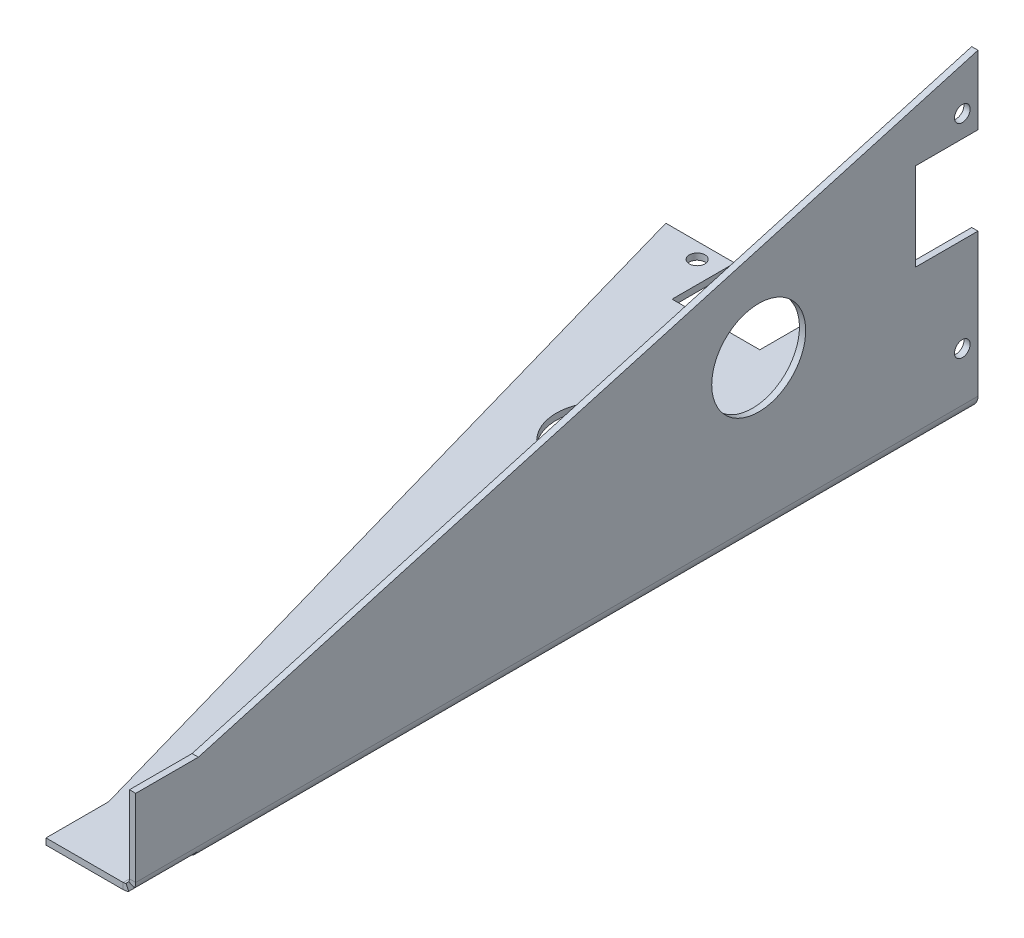
ISO-10303-21;
HEADER;
FILE_DESCRIPTION(('STEP AP214'),'2;1');
FILE_NAME('part.step','',(''),(''),'','','');
FILE_SCHEMA(('AUTOMOTIVE_DESIGN { 1 0 10303 214 1 1 1 1 }'));
ENDSEC;
DATA;
#1=APPLICATION_CONTEXT('core data for automotive mechanical design processes');
#2=APPLICATION_PROTOCOL_DEFINITION('international standard','automotive_design',2000,#1);
#3=PRODUCT_CONTEXT('',#1,'mechanical');
#4=PRODUCT('Part','Part','',(#3));
#5=PRODUCT_RELATED_PRODUCT_CATEGORY('part','',(#4));
#6=PRODUCT_DEFINITION_FORMATION('','',#4);
#7=PRODUCT_DEFINITION_CONTEXT('part definition',#1,'design');
#8=PRODUCT_DEFINITION('design','',#6,#7);
#9=PRODUCT_DEFINITION_SHAPE('','',#8);
#10=(LENGTH_UNIT() NAMED_UNIT(*) SI_UNIT(.MILLI.,.METRE.));
#11=(NAMED_UNIT(*) PLANE_ANGLE_UNIT() SI_UNIT($,.RADIAN.));
#12=(NAMED_UNIT(*) SI_UNIT($,.STERADIAN.) SOLID_ANGLE_UNIT());
#13=UNCERTAINTY_MEASURE_WITH_UNIT(LENGTH_MEASURE(1.E-05),#10,'distance_accuracy_value','');
#14=(GEOMETRIC_REPRESENTATION_CONTEXT(3) GLOBAL_UNCERTAINTY_ASSIGNED_CONTEXT((#13)) GLOBAL_UNIT_ASSIGNED_CONTEXT((#10,
#11,#12)) REPRESENTATION_CONTEXT('',''));
#15=CARTESIAN_POINT('',(0.,0.,0.));
#16=DIRECTION('',(0.,0.,1.));
#17=DIRECTION('',(1.,0.,0.));
#18=AXIS2_PLACEMENT_3D('',#15,#16,#17);
#19=CARTESIAN_POINT('',(-0.356194490192342,-0.356194490192343,0.));
#20=DIRECTION('',(1.,0.,0.));
#21=DIRECTION('',(0.,0.,-1.));
#22=AXIS2_PLACEMENT_3D('',#19,#20,#21);
#23=PLANE('',#22);
#24=CARTESIAN_POINT('',(-0.35619449019251,47.6438055098077,-198.86));
#25=DIRECTION('',(-1.,0.,0.));
#26=DIRECTION('',(0.,0.,1.));
#27=AXIS2_PLACEMENT_3D('',#24,#25,#26);
#28=CIRCLE('',#27,15.);
#29=CARTESIAN_POINT('',(-0.35619449019251,47.6438055098077,-183.86));
#30=VERTEX_POINT('',#29);
#31=EDGE_CURVE('E293',#30,#30,#28,.T.);
#32=ORIENTED_EDGE('',*,*,#31,.F.);
#33=EDGE_LOOP('',(#32));
#34=FACE_BOUND('',#33,.T.);
#35=CARTESIAN_POINT('',(-0.356194490192632,82.6438055098076,-263.86));
#36=DIRECTION('',(-1.,0.,0.));
#37=DIRECTION('',(0.,0.,1.));
#38=AXIS2_PLACEMENT_3D('',#35,#36,#37);
#39=CIRCLE('',#38,2.50000000000001);
#40=CARTESIAN_POINT('',(-0.356194490192632,82.6438055098076,-261.36));
#41=VERTEX_POINT('',#40);
#42=EDGE_CURVE('E285',#41,#41,#39,.T.);
#43=ORIENTED_EDGE('',*,*,#42,.F.);
#44=EDGE_LOOP('',(#43));
#45=FACE_BOUND('',#44,.T.);
#46=CARTESIAN_POINT('',(-0.356194490192405,17.6438055098077,-263.86));
#47=DIRECTION('',(-1.,0.,0.));
#48=DIRECTION('',(0.,0.,1.));
#49=AXIS2_PLACEMENT_3D('',#46,#47,#48);
#50=CIRCLE('',#49,2.5);
#51=CARTESIAN_POINT('',(-0.356194490192405,17.6438055098077,-261.36));
#52=VERTEX_POINT('',#51);
#53=EDGE_CURVE('E286',#52,#52,#50,.T.);
#54=ORIENTED_EDGE('',*,*,#53,.F.);
#55=EDGE_LOOP('',(#54));
#56=FACE_BOUND('',#55,.T.);
#57=DIRECTION('',(0.,-1.,0.));
#58=VECTOR('',#57,1.);
#59=CARTESIAN_POINT('',(-0.35619449019251,47.6438055098077,-268.86));
#60=LINE('',#59,#58);
#61=CARTESIAN_POINT('',(-0.35619449019251,47.6438055098077,-268.86));
#62=VERTEX_POINT('',#61);
#63=CARTESIAN_POINT('',(-0.35619449019235,2.00000000000001,-268.86));
#64=VERTEX_POINT('',#63);
#65=EDGE_CURVE('E58',#62,#64,#60,.T.);
#66=ORIENTED_EDGE('',*,*,#65,.T.);
#67=DIRECTION('',(0.,0.,1.));
#68=VECTOR('',#67,1.);
#69=CARTESIAN_POINT('',(-0.35619449019235,2.00000000000001,0.));
#70=LINE('',#69,#68);
#71=CARTESIAN_POINT('',(-0.35619449019235,2.00000000000001,0.));
#72=VERTEX_POINT('',#71);
#73=EDGE_CURVE('E50',#64,#72,#70,.T.);
#74=ORIENTED_EDGE('',*,*,#73,.T.);
#75=DIRECTION('',(0.,1.,0.));
#76=VECTOR('',#75,1.);
#77=CARTESIAN_POINT('',(-0.356194490192346,0.64380550980766,0.));
#78=LINE('',#77,#76);
#79=CARTESIAN_POINT('',(-0.356194490192436,26.6438055098077,0.));
#80=VERTEX_POINT('',#79);
#81=EDGE_CURVE('E66',#72,#80,#78,.T.);
#82=ORIENTED_EDGE('',*,*,#81,.T.);
#83=DIRECTION('',(0.,0.,-1.));
#84=VECTOR('',#83,1.);
#85=CARTESIAN_POINT('',(-0.356194490192436,26.6438055098077,0.));
#86=LINE('',#85,#84);
#87=CARTESIAN_POINT('',(-0.356194490192436,26.6438055098077,-20.));
#88=VERTEX_POINT('',#87);
#89=EDGE_CURVE('E320',#80,#88,#86,.T.);
#90=ORIENTED_EDGE('',*,*,#89,.T.);
#91=DIRECTION('',(0.,0.274353650382612,-0.961628865270659));
#92=VECTOR('',#91,1.);
#93=CARTESIAN_POINT('',(-0.356194490192436,26.6438055098077,-20.));
#94=LINE('',#93,#92);
#95=CARTESIAN_POINT('',(-0.356194490192684,97.6438055098076,-268.86));
#96=VERTEX_POINT('',#95);
#97=EDGE_CURVE('E323',#88,#96,#94,.T.);
#98=ORIENTED_EDGE('',*,*,#97,.T.);
#99=DIRECTION('',(0.,-1.,0.));
#100=VECTOR('',#99,1.);
#101=CARTESIAN_POINT('',(-0.356194490192684,97.6438055098076,-268.86));
#102=LINE('',#101,#100);
#103=CARTESIAN_POINT('',(-0.356194490192608,75.6438055098077,-268.86));
#104=VERTEX_POINT('',#103);
#105=EDGE_CURVE('E326',#96,#104,#102,.T.);
#106=ORIENTED_EDGE('',*,*,#105,.T.);
#107=DIRECTION('',(0.,0.,1.));
#108=VECTOR('',#107,1.);
#109=CARTESIAN_POINT('',(-0.356194490192608,75.6438055098077,-268.86));
#110=LINE('',#109,#108);
#111=CARTESIAN_POINT('',(-0.356194490192608,75.6438055098076,-248.86));
#112=VERTEX_POINT('',#111);
#113=EDGE_CURVE('E329',#104,#112,#110,.T.);
#114=ORIENTED_EDGE('',*,*,#113,.T.);
#115=DIRECTION('',(0.,-1.,0.));
#116=VECTOR('',#115,1.);
#117=CARTESIAN_POINT('',(-0.356194490192608,75.6438055098076,-248.86));
#118=LINE('',#117,#116);
#119=CARTESIAN_POINT('',(-0.35619449019251,47.6438055098077,-248.86));
#120=VERTEX_POINT('',#119);
#121=EDGE_CURVE('E332',#112,#120,#118,.T.);
#122=ORIENTED_EDGE('',*,*,#121,.T.);
#123=DIRECTION('',(0.,0.,-1.));
#124=VECTOR('',#123,1.);
#125=CARTESIAN_POINT('',(-0.35619449019251,47.6438055098077,-248.86));
#126=LINE('',#125,#124);
#127=EDGE_CURVE('E335',#120,#62,#126,.T.);
#128=ORIENTED_EDGE('',*,*,#127,.T.);
#129=EDGE_LOOP('',(#66,#74,#82,#90,#98,#106,#114,#122,#128));
#130=FACE_BOUND('',#129,.T.);
#131=ADVANCED_FACE('F41',(#34,#45,#56,#130),#23,.F.);
#132=CARTESIAN_POINT('',(1.64380550980749,47.6438055098077,-268.86));
#133=DIRECTION('',(0.,0.,-1.));
#134=DIRECTION('',(0.,-1.,0.));
#135=AXIS2_PLACEMENT_3D('',#132,#133,#134);
#136=PLANE('',#135);
#137=DIRECTION('',(1.,0.,0.));
#138=VECTOR('',#137,1.);
#139=CARTESIAN_POINT('',(1.64380550980765,2.00000000000002,-268.86));
#140=LINE('',#139,#138);
#141=CARTESIAN_POINT('',(1.64380550980765,2.00000000000002,-268.86));
#142=VERTEX_POINT('',#141);
#143=EDGE_CURVE('E12',#64,#142,#140,.T.);
#144=ORIENTED_EDGE('',*,*,#143,.F.);
#145=ORIENTED_EDGE('',*,*,#65,.F.);
#146=DIRECTION('',(-1.,0.,0.));
#147=VECTOR('',#146,1.);
#148=CARTESIAN_POINT('',(1.64380550980749,47.6438055098077,-268.86));
#149=LINE('',#148,#147);
#150=CARTESIAN_POINT('',(1.64380550980749,47.6438055098077,-268.86));
#151=VERTEX_POINT('',#150);
#152=EDGE_CURVE('E337',#151,#62,#149,.T.);
#153=ORIENTED_EDGE('',*,*,#152,.F.);
#154=DIRECTION('',(0.,-1.,0.));
#155=VECTOR('',#154,1.);
#156=CARTESIAN_POINT('',(1.64380550980749,47.6438055098077,-268.86));
#157=LINE('',#156,#155);
#158=EDGE_CURVE('E319',#151,#142,#157,.T.);
#159=ORIENTED_EDGE('',*,*,#158,.T.);
#160=EDGE_LOOP('',(#144,#145,#153,#159));
#161=FACE_BOUND('',#160,.T.);
#162=ADVANCED_FACE('F43',(#161),#136,.T.);
#163=CARTESIAN_POINT('',(1.64380550980749,47.6438055098077,-248.86));
#164=DIRECTION('',(0.,1.,0.));
#165=DIRECTION('',(0.,0.,-1.));
#166=AXIS2_PLACEMENT_3D('',#163,#164,#165);
#167=PLANE('',#166);
#168=ORIENTED_EDGE('',*,*,#127,.F.);
#169=DIRECTION('',(-1.,0.,0.));
#170=VECTOR('',#169,1.);
#171=CARTESIAN_POINT('',(1.64380550980749,47.6438055098077,-248.86));
#172=LINE('',#171,#170);
#173=CARTESIAN_POINT('',(1.64380550980749,47.6438055098077,-248.86));
#174=VERTEX_POINT('',#173);
#175=EDGE_CURVE('E340',#174,#120,#172,.T.);
#176=ORIENTED_EDGE('',*,*,#175,.F.);
#177=DIRECTION('',(0.,0.,-1.));
#178=VECTOR('',#177,1.);
#179=CARTESIAN_POINT('',(1.64380550980749,47.6438055098077,-248.86));
#180=LINE('',#179,#178);
#181=EDGE_CURVE('E316',#174,#151,#180,.T.);
#182=ORIENTED_EDGE('',*,*,#181,.T.);
#183=ORIENTED_EDGE('',*,*,#152,.T.);
#184=EDGE_LOOP('',(#168,#176,#182,#183));
#185=FACE_BOUND('',#184,.T.);
#186=ADVANCED_FACE('F482',(#185),#167,.T.);
#187=CARTESIAN_POINT('',(1.64380550980739,75.6438055098077,-248.86));
#188=DIRECTION('',(0.,0.,-1.));
#189=DIRECTION('',(0.,-1.,0.));
#190=AXIS2_PLACEMENT_3D('',#187,#188,#189);
#191=PLANE('',#190);
#192=ORIENTED_EDGE('',*,*,#121,.F.);
#193=DIRECTION('',(-1.,0.,0.));
#194=VECTOR('',#193,1.);
#195=CARTESIAN_POINT('',(1.64380550980739,75.6438055098077,-248.86));
#196=LINE('',#195,#194);
#197=CARTESIAN_POINT('',(1.64380550980739,75.6438055098077,-248.86));
#198=VERTEX_POINT('',#197);
#199=EDGE_CURVE('E342',#198,#112,#196,.T.);
#200=ORIENTED_EDGE('',*,*,#199,.F.);
#201=DIRECTION('',(0.,-1.,0.));
#202=VECTOR('',#201,1.);
#203=CARTESIAN_POINT('',(1.64380550980739,75.6438055098077,-248.86));
#204=LINE('',#203,#202);
#205=EDGE_CURVE('E313',#198,#174,#204,.T.);
#206=ORIENTED_EDGE('',*,*,#205,.T.);
#207=ORIENTED_EDGE('',*,*,#175,.T.);
#208=EDGE_LOOP('',(#192,#200,#206,#207));
#209=FACE_BOUND('',#208,.T.);
#210=ADVANCED_FACE('F503',(#209),#191,.T.);
#211=CARTESIAN_POINT('',(1.64380550980739,75.6438055098077,-268.86));
#212=DIRECTION('',(0.,-1.,0.));
#213=DIRECTION('',(0.,0.,1.));
#214=AXIS2_PLACEMENT_3D('',#211,#212,#213);
#215=PLANE('',#214);
#216=ORIENTED_EDGE('',*,*,#113,.F.);
#217=DIRECTION('',(-1.,0.,0.));
#218=VECTOR('',#217,1.);
#219=CARTESIAN_POINT('',(1.64380550980739,75.6438055098077,-268.86));
#220=LINE('',#219,#218);
#221=CARTESIAN_POINT('',(1.64380550980739,75.6438055098077,-268.86));
#222=VERTEX_POINT('',#221);
#223=EDGE_CURVE('E344',#222,#104,#220,.T.);
#224=ORIENTED_EDGE('',*,*,#223,.F.);
#225=DIRECTION('',(0.,0.,1.));
#226=VECTOR('',#225,1.);
#227=CARTESIAN_POINT('',(1.64380550980739,75.6438055098077,-268.86));
#228=LINE('',#227,#226);
#229=EDGE_CURVE('E310',#222,#198,#228,.T.);
#230=ORIENTED_EDGE('',*,*,#229,.T.);
#231=ORIENTED_EDGE('',*,*,#199,.T.);
#232=EDGE_LOOP('',(#216,#224,#230,#231));
#233=FACE_BOUND('',#232,.T.);
#234=ADVANCED_FACE('F499',(#233),#215,.T.);
#235=CARTESIAN_POINT('',(1.64380550980732,97.6438055098077,-268.86));
#236=DIRECTION('',(0.,0.,-1.));
#237=DIRECTION('',(0.,-1.,0.));
#238=AXIS2_PLACEMENT_3D('',#235,#236,#237);
#239=PLANE('',#238);
#240=ORIENTED_EDGE('',*,*,#105,.F.);
#241=DIRECTION('',(-1.,0.,0.));
#242=VECTOR('',#241,1.);
#243=CARTESIAN_POINT('',(1.64380550980732,97.6438055098077,-268.86));
#244=LINE('',#243,#242);
#245=CARTESIAN_POINT('',(1.64380550980732,97.6438055098077,-268.86));
#246=VERTEX_POINT('',#245);
#247=EDGE_CURVE('E346',#246,#96,#244,.T.);
#248=ORIENTED_EDGE('',*,*,#247,.F.);
#249=DIRECTION('',(0.,-1.,0.));
#250=VECTOR('',#249,1.);
#251=CARTESIAN_POINT('',(1.64380550980732,97.6438055098077,-268.86));
#252=LINE('',#251,#250);
#253=EDGE_CURVE('E307',#246,#222,#252,.T.);
#254=ORIENTED_EDGE('',*,*,#253,.T.);
#255=ORIENTED_EDGE('',*,*,#223,.T.);
#256=EDGE_LOOP('',(#240,#248,#254,#255));
#257=FACE_BOUND('',#256,.T.);
#258=ADVANCED_FACE('F496',(#257),#239,.T.);
#259=CARTESIAN_POINT('',(1.64380550980756,26.6438055098077,-20.));
#260=DIRECTION('',(0.,0.961628865270659,0.274353650382612));
#261=DIRECTION('',(0.,0.274353650382612,-0.961628865270659));
#262=AXIS2_PLACEMENT_3D('',#259,#260,#261);
#263=PLANE('',#262);
#264=ORIENTED_EDGE('',*,*,#97,.F.);
#265=DIRECTION('',(-1.,0.,0.));
#266=VECTOR('',#265,1.);
#267=CARTESIAN_POINT('',(1.64380550980756,26.6438055098077,-20.));
#268=LINE('',#267,#266);
#269=CARTESIAN_POINT('',(1.64380550980756,26.6438055098077,-20.));
#270=VERTEX_POINT('',#269);
#271=EDGE_CURVE('E348',#270,#88,#268,.T.);
#272=ORIENTED_EDGE('',*,*,#271,.F.);
#273=DIRECTION('',(0.,0.274353650382612,-0.961628865270659));
#274=VECTOR('',#273,1.);
#275=CARTESIAN_POINT('',(1.64380550980756,26.6438055098077,-20.));
#276=LINE('',#275,#274);
#277=EDGE_CURVE('E304',#270,#246,#276,.T.);
#278=ORIENTED_EDGE('',*,*,#277,.T.);
#279=ORIENTED_EDGE('',*,*,#247,.T.);
#280=EDGE_LOOP('',(#264,#272,#278,#279));
#281=FACE_BOUND('',#280,.T.);
#282=ADVANCED_FACE('F375',(#281),#263,.T.);
#283=CARTESIAN_POINT('',(1.64380550980756,26.6438055098077,0.));
#284=DIRECTION('',(0.,1.,0.));
#285=DIRECTION('',(0.,0.,-1.));
#286=AXIS2_PLACEMENT_3D('',#283,#284,#285);
#287=PLANE('',#286);
#288=ORIENTED_EDGE('',*,*,#89,.F.);
#289=DIRECTION('',(-1.,0.,0.));
#290=VECTOR('',#289,1.);
#291=CARTESIAN_POINT('',(1.64380550980756,26.6438055098077,0.));
#292=LINE('',#291,#290);
#293=CARTESIAN_POINT('',(1.64380550980756,26.6438055098077,0.));
#294=VERTEX_POINT('',#293);
#295=EDGE_CURVE('E350',#294,#80,#292,.T.);
#296=ORIENTED_EDGE('',*,*,#295,.F.);
#297=DIRECTION('',(0.,0.,-1.));
#298=VECTOR('',#297,1.);
#299=CARTESIAN_POINT('',(1.64380550980756,26.6438055098077,0.));
#300=LINE('',#299,#298);
#301=EDGE_CURVE('E301',#294,#270,#300,.T.);
#302=ORIENTED_EDGE('',*,*,#301,.T.);
#303=ORIENTED_EDGE('',*,*,#271,.T.);
#304=EDGE_LOOP('',(#288,#296,#302,#303));
#305=FACE_BOUND('',#304,.T.);
#306=ADVANCED_FACE('F367',(#305),#287,.T.);
#307=CARTESIAN_POINT('',(1.64380550980765,0.643805509807667,0.));
#308=DIRECTION('',(0.,0.,1.));
#309=DIRECTION('',(0.,1.,0.));
#310=AXIS2_PLACEMENT_3D('',#307,#308,#309);
#311=PLANE('',#310);
#312=DIRECTION('',(-1.,0.,0.));
#313=VECTOR('',#312,1.);
#314=CARTESIAN_POINT('',(1.64380550980765,2.00000000000001,0.));
#315=LINE('',#314,#313);
#316=CARTESIAN_POINT('',(1.64380550980765,2.00000000000001,-1.11022302462516E-13));
#317=VERTEX_POINT('',#316);
#318=EDGE_CURVE('E354',#317,#72,#315,.T.);
#319=ORIENTED_EDGE('',*,*,#318,.F.);
#320=DIRECTION('',(0.,1.,0.));
#321=VECTOR('',#320,1.);
#322=CARTESIAN_POINT('',(1.64380550980765,0.643805509807667,0.));
#323=LINE('',#322,#321);
#324=EDGE_CURVE('E45',#317,#294,#323,.T.);
#325=ORIENTED_EDGE('',*,*,#324,.T.);
#326=ORIENTED_EDGE('',*,*,#295,.T.);
#327=ORIENTED_EDGE('',*,*,#81,.F.);
#328=EDGE_LOOP('',(#319,#325,#326,#327));
#329=FACE_BOUND('',#328,.T.);
#330=ADVANCED_FACE('F362',(#329),#311,.T.);
#331=CARTESIAN_POINT('',(1.64380550980766,-0.356194490192336,0.));
#332=DIRECTION('',(1.,0.,0.));
#333=DIRECTION('',(0.,0.,-1.));
#334=AXIS2_PLACEMENT_3D('',#331,#332,#333);
#335=PLANE('',#334);
#336=DIRECTION('',(0.,0.,1.));
#337=VECTOR('',#336,1.);
#338=CARTESIAN_POINT('',(1.64380550980765,2.00000000000001,0.));
#339=LINE('',#338,#337);
#340=EDGE_CURVE('E339',#142,#317,#339,.T.);
#341=ORIENTED_EDGE('',*,*,#340,.F.);
#342=ORIENTED_EDGE('',*,*,#158,.F.);
#343=ORIENTED_EDGE('',*,*,#181,.F.);
#344=ORIENTED_EDGE('',*,*,#205,.F.);
#345=ORIENTED_EDGE('',*,*,#229,.F.);
#346=ORIENTED_EDGE('',*,*,#253,.F.);
#347=ORIENTED_EDGE('',*,*,#277,.F.);
#348=ORIENTED_EDGE('',*,*,#301,.F.);
#349=ORIENTED_EDGE('',*,*,#324,.F.);
#350=EDGE_LOOP('',(#341,#342,#343,#344,#345,#346,#347,#348,#349));
#351=FACE_BOUND('',#350,.T.);
#352=CARTESIAN_POINT('',(1.64380550980759,17.6438055098077,-263.86));
#353=DIRECTION('',(-1.,0.,0.));
#354=DIRECTION('',(0.,0.,1.));
#355=AXIS2_PLACEMENT_3D('',#352,#353,#354);
#356=CIRCLE('',#355,2.5);
#357=CARTESIAN_POINT('',(1.64380550980759,17.6438055098077,-261.36));
#358=VERTEX_POINT('',#357);
#359=EDGE_CURVE('E282',#358,#358,#356,.T.);
#360=ORIENTED_EDGE('',*,*,#359,.T.);
#361=EDGE_LOOP('',(#360));
#362=FACE_BOUND('',#361,.T.);
#363=CARTESIAN_POINT('',(1.64380550980737,82.6438055098077,-263.86));
#364=DIRECTION('',(-1.,0.,0.));
#365=DIRECTION('',(0.,0.,1.));
#366=AXIS2_PLACEMENT_3D('',#363,#364,#365);
#367=CIRCLE('',#366,2.50000000000001);
#368=CARTESIAN_POINT('',(1.64380550980737,82.6438055098077,-261.36));
#369=VERTEX_POINT('',#368);
#370=EDGE_CURVE('E290',#369,#369,#367,.T.);
#371=ORIENTED_EDGE('',*,*,#370,.T.);
#372=EDGE_LOOP('',(#371));
#373=FACE_BOUND('',#372,.T.);
#374=CARTESIAN_POINT('',(1.64380550980749,47.6438055098077,-198.86));
#375=DIRECTION('',(-1.,0.,0.));
#376=DIRECTION('',(0.,0.,1.));
#377=AXIS2_PLACEMENT_3D('',#374,#375,#376);
#378=CIRCLE('',#377,15.);
#379=CARTESIAN_POINT('',(1.64380550980749,47.6438055098077,-183.86));
#380=VERTEX_POINT('',#379);
#381=EDGE_CURVE('E296',#380,#380,#378,.T.);
#382=ORIENTED_EDGE('',*,*,#381,.T.);
#383=EDGE_LOOP('',(#382));
#384=FACE_BOUND('',#383,.T.);
#385=ADVANCED_FACE('F369',(#351,#362,#373,#384),#335,.T.);
#386=CARTESIAN_POINT('',(1.64380550980749,47.6438055098077,-198.86));
#387=DIRECTION('',(-1.,0.,0.));
#388=DIRECTION('',(0.,0.,1.));
#389=AXIS2_PLACEMENT_3D('',#386,#387,#388);
#390=CYLINDRICAL_SURFACE('',#389,15.);
#391=ORIENTED_EDGE('',*,*,#381,.F.);
#392=EDGE_LOOP('',(#391));
#393=FACE_BOUND('',#392,.T.);
#394=ORIENTED_EDGE('',*,*,#31,.T.);
#395=EDGE_LOOP('',(#394));
#396=FACE_BOUND('',#395,.T.);
#397=ADVANCED_FACE('F491',(#393,#396),#390,.F.);
#398=CARTESIAN_POINT('',(1.64380550980737,82.6438055098077,-263.86));
#399=DIRECTION('',(-1.,0.,0.));
#400=DIRECTION('',(0.,0.,1.));
#401=AXIS2_PLACEMENT_3D('',#398,#399,#400);
#402=CYLINDRICAL_SURFACE('',#401,2.50000000000001);
#403=ORIENTED_EDGE('',*,*,#370,.F.);
#404=EDGE_LOOP('',(#403));
#405=FACE_BOUND('',#404,.T.);
#406=ORIENTED_EDGE('',*,*,#42,.T.);
#407=EDGE_LOOP('',(#406));
#408=FACE_BOUND('',#407,.T.);
#409=ADVANCED_FACE('F513',(#405,#408),#402,.F.);
#410=CARTESIAN_POINT('',(1.64380550980759,17.6438055098077,-263.86));
#411=DIRECTION('',(-1.,0.,0.));
#412=DIRECTION('',(0.,0.,1.));
#413=AXIS2_PLACEMENT_3D('',#410,#411,#412);
#414=CYLINDRICAL_SURFACE('',#413,2.5);
#415=ORIENTED_EDGE('',*,*,#359,.F.);
#416=EDGE_LOOP('',(#415));
#417=FACE_BOUND('',#416,.T.);
#418=ORIENTED_EDGE('',*,*,#53,.T.);
#419=EDGE_LOOP('',(#418));
#420=FACE_BOUND('',#419,.T.);
#421=ADVANCED_FACE('F517',(#417,#420),#414,.F.);
#422=CARTESIAN_POINT('',(-48.,-2.,-248.86));
#423=DIRECTION('',(-1.,0.,0.));
#424=DIRECTION('',(0.,0.,1.));
#425=AXIS2_PLACEMENT_3D('',#422,#423,#424);
#426=PLANE('',#425);
#427=DIRECTION('',(0.,0.,1.));
#428=VECTOR('',#427,1.);
#429=CARTESIAN_POINT('',(-48.,0.,-248.86));
#430=LINE('',#429,#428);
#431=CARTESIAN_POINT('',(-48.,0.,-268.86));
#432=VERTEX_POINT('',#431);
#433=CARTESIAN_POINT('',(-48.,0.,-248.86));
#434=VERTEX_POINT('',#433);
#435=EDGE_CURVE('E434',#432,#434,#430,.T.);
#436=ORIENTED_EDGE('',*,*,#435,.F.);
#437=DIRECTION('',(0.,1.,0.));
#438=VECTOR('',#437,1.);
#439=CARTESIAN_POINT('',(-48.,-2.,-268.86));
#440=LINE('',#439,#438);
#441=CARTESIAN_POINT('',(-48.,-2.,-268.86));
#442=VERTEX_POINT('',#441);
#443=EDGE_CURVE('E289',#442,#432,#440,.T.);
#444=ORIENTED_EDGE('',*,*,#443,.F.);
#445=DIRECTION('',(0.,0.,1.));
#446=VECTOR('',#445,1.);
#447=CARTESIAN_POINT('',(-48.,-2.,-248.86));
#448=LINE('',#447,#446);
#449=CARTESIAN_POINT('',(-48.,-2.,-248.86));
#450=VERTEX_POINT('',#449);
#451=EDGE_CURVE('E276',#442,#450,#448,.T.);
#452=ORIENTED_EDGE('',*,*,#451,.T.);
#453=DIRECTION('',(0.,1.,0.));
#454=VECTOR('',#453,1.);
#455=CARTESIAN_POINT('',(-48.,-2.,-248.86));
#456=LINE('',#455,#454);
#457=EDGE_CURVE('E274',#450,#434,#456,.T.);
#458=ORIENTED_EDGE('',*,*,#457,.T.);
#459=EDGE_LOOP('',(#436,#444,#452,#458));
#460=FACE_BOUND('',#459,.T.);
#461=ADVANCED_FACE('F446',(#460),#426,.T.);
#462=CARTESIAN_POINT('',(-76.,-2.,-248.86));
#463=DIRECTION('',(0.,0.,-1.));
#464=DIRECTION('',(-1.,0.,0.));
#465=AXIS2_PLACEMENT_3D('',#462,#463,#464);
#466=PLANE('',#465);
#467=DIRECTION('',(-1.,0.,0.));
#468=VECTOR('',#467,1.);
#469=CARTESIAN_POINT('',(-76.,0.,-248.86));
#470=LINE('',#469,#468);
#471=CARTESIAN_POINT('',(-76.,0.,-248.86));
#472=VERTEX_POINT('',#471);
#473=EDGE_CURVE('E431',#434,#472,#470,.T.);
#474=ORIENTED_EDGE('',*,*,#473,.F.);
#475=ORIENTED_EDGE('',*,*,#457,.F.);
#476=DIRECTION('',(-1.,0.,0.));
#477=VECTOR('',#476,1.);
#478=CARTESIAN_POINT('',(-76.,-2.,-248.86));
#479=LINE('',#478,#477);
#480=CARTESIAN_POINT('',(-76.,-2.,-248.86));
#481=VERTEX_POINT('',#480);
#482=EDGE_CURVE('E271',#450,#481,#479,.T.);
#483=ORIENTED_EDGE('',*,*,#482,.T.);
#484=DIRECTION('',(0.,1.,0.));
#485=VECTOR('',#484,1.);
#486=CARTESIAN_POINT('',(-76.,-2.,-248.86));
#487=LINE('',#486,#485);
#488=EDGE_CURVE('E269',#481,#472,#487,.T.);
#489=ORIENTED_EDGE('',*,*,#488,.T.);
#490=EDGE_LOOP('',(#474,#475,#483,#489));
#491=FACE_BOUND('',#490,.T.);
#492=ADVANCED_FACE('F450',(#491),#466,.T.);
#493=CARTESIAN_POINT('',(-76.,-2.,-268.86));
#494=DIRECTION('',(1.,0.,0.));
#495=DIRECTION('',(0.,0.,-1.));
#496=AXIS2_PLACEMENT_3D('',#493,#494,#495);
#497=PLANE('',#496);
#498=DIRECTION('',(0.,0.,-1.));
#499=VECTOR('',#498,1.);
#500=CARTESIAN_POINT('',(-76.,0.,-268.86));
#501=LINE('',#500,#499);
#502=CARTESIAN_POINT('',(-76.,0.,-268.86));
#503=VERTEX_POINT('',#502);
#504=EDGE_CURVE('E428',#472,#503,#501,.T.);
#505=ORIENTED_EDGE('',*,*,#504,.F.);
#506=ORIENTED_EDGE('',*,*,#488,.F.);
#507=DIRECTION('',(0.,0.,-1.));
#508=VECTOR('',#507,1.);
#509=CARTESIAN_POINT('',(-76.,-2.,-268.86));
#510=LINE('',#509,#508);
#511=CARTESIAN_POINT('',(-76.,-2.,-268.86));
#512=VERTEX_POINT('',#511);
#513=EDGE_CURVE('E266',#481,#512,#510,.T.);
#514=ORIENTED_EDGE('',*,*,#513,.T.);
#515=DIRECTION('',(0.,1.,0.));
#516=VECTOR('',#515,1.);
#517=CARTESIAN_POINT('',(-76.,-2.,-268.86));
#518=LINE('',#517,#516);
#519=EDGE_CURVE('E264',#512,#503,#518,.T.);
#520=ORIENTED_EDGE('',*,*,#519,.T.);
#521=EDGE_LOOP('',(#505,#506,#514,#520));
#522=FACE_BOUND('',#521,.T.);
#523=ADVANCED_FACE('F454',(#522),#497,.T.);
#524=CARTESIAN_POINT('',(-98.,-2.,-268.86));
#525=DIRECTION('',(0.,0.,-1.));
#526=DIRECTION('',(-1.,0.,0.));
#527=AXIS2_PLACEMENT_3D('',#524,#525,#526);
#528=PLANE('',#527);
#529=DIRECTION('',(-1.,0.,0.));
#530=VECTOR('',#529,1.);
#531=CARTESIAN_POINT('',(-98.,0.,-268.86));
#532=LINE('',#531,#530);
#533=CARTESIAN_POINT('',(-98.,0.,-268.86));
#534=VERTEX_POINT('',#533);
#535=EDGE_CURVE('E425',#503,#534,#532,.T.);
#536=ORIENTED_EDGE('',*,*,#535,.F.);
#537=ORIENTED_EDGE('',*,*,#519,.F.);
#538=DIRECTION('',(-1.,0.,0.));
#539=VECTOR('',#538,1.);
#540=CARTESIAN_POINT('',(-98.,-2.,-268.86));
#541=LINE('',#540,#539);
#542=CARTESIAN_POINT('',(-98.,-2.,-268.86));
#543=VERTEX_POINT('',#542);
#544=EDGE_CURVE('E261',#512,#543,#541,.T.);
#545=ORIENTED_EDGE('',*,*,#544,.T.);
#546=DIRECTION('',(0.,1.,0.));
#547=VECTOR('',#546,1.);
#548=CARTESIAN_POINT('',(-98.,-2.,-268.86));
#549=LINE('',#548,#547);
#550=EDGE_CURVE('E259',#543,#534,#549,.T.);
#551=ORIENTED_EDGE('',*,*,#550,.T.);
#552=EDGE_LOOP('',(#536,#537,#545,#551));
#553=FACE_BOUND('',#552,.T.);
#554=ADVANCED_FACE('F458',(#553),#528,.T.);
#555=CARTESIAN_POINT('',(-27.,-2.,-20.));
#556=DIRECTION('',(-0.961628865270659,0.,0.274353650382612));
#557=DIRECTION('',(0.274353650382612,0.,0.961628865270659));
#558=AXIS2_PLACEMENT_3D('',#555,#556,#557);
#559=PLANE('',#558);
#560=DIRECTION('',(0.274353650382612,0.,0.961628865270659));
#561=VECTOR('',#560,1.);
#562=CARTESIAN_POINT('',(-27.,0.,-20.));
#563=LINE('',#562,#561);
#564=CARTESIAN_POINT('',(-27.,0.,-20.));
#565=VERTEX_POINT('',#564);
#566=EDGE_CURVE('E422',#534,#565,#563,.T.);
#567=ORIENTED_EDGE('',*,*,#566,.F.);
#568=ORIENTED_EDGE('',*,*,#550,.F.);
#569=DIRECTION('',(0.274353650382612,0.,0.961628865270659));
#570=VECTOR('',#569,1.);
#571=CARTESIAN_POINT('',(-27.,-2.,-20.));
#572=LINE('',#571,#570);
#573=CARTESIAN_POINT('',(-27.,-2.,-20.));
#574=VERTEX_POINT('',#573);
#575=EDGE_CURVE('E256',#543,#574,#572,.T.);
#576=ORIENTED_EDGE('',*,*,#575,.T.);
#577=DIRECTION('',(0.,1.,0.));
#578=VECTOR('',#577,1.);
#579=CARTESIAN_POINT('',(-27.,-2.,-20.));
#580=LINE('',#579,#578);
#581=EDGE_CURVE('E254',#574,#565,#580,.T.);
#582=ORIENTED_EDGE('',*,*,#581,.T.);
#583=EDGE_LOOP('',(#567,#568,#576,#582));
#584=FACE_BOUND('',#583,.T.);
#585=ADVANCED_FACE('F462',(#584),#559,.T.);
#586=CARTESIAN_POINT('',(-27.,-2.,0.));
#587=DIRECTION('',(-1.,0.,0.));
#588=DIRECTION('',(0.,0.,1.));
#589=AXIS2_PLACEMENT_3D('',#586,#587,#588);
#590=PLANE('',#589);
#591=DIRECTION('',(0.,0.,1.));
#592=VECTOR('',#591,1.);
#593=CARTESIAN_POINT('',(-27.,0.,0.));
#594=LINE('',#593,#592);
#595=CARTESIAN_POINT('',(-27.,0.,0.));
#596=VERTEX_POINT('',#595);
#597=EDGE_CURVE('E419',#565,#596,#594,.T.);
#598=ORIENTED_EDGE('',*,*,#597,.F.);
#599=ORIENTED_EDGE('',*,*,#581,.F.);
#600=DIRECTION('',(0.,0.,1.));
#601=VECTOR('',#600,1.);
#602=CARTESIAN_POINT('',(-27.,-2.,0.));
#603=LINE('',#602,#601);
#604=CARTESIAN_POINT('',(-27.,-2.,0.));
#605=VERTEX_POINT('',#604);
#606=EDGE_CURVE('E252',#574,#605,#603,.T.);
#607=ORIENTED_EDGE('',*,*,#606,.T.);
#608=DIRECTION('',(0.,1.,0.));
#609=VECTOR('',#608,1.);
#610=CARTESIAN_POINT('',(-27.,-2.,0.));
#611=LINE('',#610,#609);
#612=EDGE_CURVE('E230',#605,#596,#611,.T.);
#613=ORIENTED_EDGE('',*,*,#612,.T.);
#614=EDGE_LOOP('',(#598,#599,#607,#613));
#615=FACE_BOUND('',#614,.T.);
#616=ADVANCED_FACE('F465',(#615),#590,.T.);
#617=CARTESIAN_POINT('',(-18.,-2.,-263.86));
#618=DIRECTION('',(0.,1.,0.));
#619=DIRECTION('',(0.,0.,1.));
#620=AXIS2_PLACEMENT_3D('',#617,#618,#619);
#621=CYLINDRICAL_SURFACE('',#620,2.5);
#622=CARTESIAN_POINT('',(-18.,-2.,-263.86));
#623=DIRECTION('',(0.,1.,0.));
#624=DIRECTION('',(0.,0.,-1.));
#625=AXIS2_PLACEMENT_3D('',#622,#623,#624);
#626=CIRCLE('',#625,2.5);
#627=CARTESIAN_POINT('',(-18.,-2.,-266.36));
#628=VERTEX_POINT('',#627);
#629=EDGE_CURVE('E227',#628,#628,#626,.T.);
#630=ORIENTED_EDGE('',*,*,#629,.F.);
#631=EDGE_LOOP('',(#630));
#632=FACE_BOUND('',#631,.T.);
#633=CARTESIAN_POINT('',(-18.,0.,-263.86));
#634=DIRECTION('',(0.,1.,0.));
#635=DIRECTION('',(0.,0.,-1.));
#636=AXIS2_PLACEMENT_3D('',#633,#634,#635);
#637=CIRCLE('',#636,2.5);
#638=CARTESIAN_POINT('',(-18.,0.,-266.36));
#639=VERTEX_POINT('',#638);
#640=EDGE_CURVE('E248',#639,#639,#637,.T.);
#641=ORIENTED_EDGE('',*,*,#640,.T.);
#642=EDGE_LOOP('',(#641));
#643=FACE_BOUND('',#642,.T.);
#644=ADVANCED_FACE('F467',(#632,#643),#621,.F.);
#645=CARTESIAN_POINT('',(-83.,-2.,-263.86));
#646=DIRECTION('',(0.,1.,0.));
#647=DIRECTION('',(0.,0.,1.));
#648=AXIS2_PLACEMENT_3D('',#645,#646,#647);
#649=CYLINDRICAL_SURFACE('',#648,2.50000000000001);
#650=CARTESIAN_POINT('',(-83.,-2.,-263.86));
#651=DIRECTION('',(0.,1.,0.));
#652=DIRECTION('',(0.,0.,-1.));
#653=AXIS2_PLACEMENT_3D('',#650,#651,#652);
#654=CIRCLE('',#653,2.50000000000001);
#655=CARTESIAN_POINT('',(-83.,-2.,-266.36));
#656=VERTEX_POINT('',#655);
#657=EDGE_CURVE('E236',#656,#656,#654,.T.);
#658=ORIENTED_EDGE('',*,*,#657,.F.);
#659=EDGE_LOOP('',(#658));
#660=FACE_BOUND('',#659,.T.);
#661=CARTESIAN_POINT('',(-83.,0.,-263.86));
#662=DIRECTION('',(0.,1.,0.));
#663=DIRECTION('',(0.,0.,-1.));
#664=AXIS2_PLACEMENT_3D('',#661,#662,#663);
#665=CIRCLE('',#664,2.50000000000001);
#666=CARTESIAN_POINT('',(-83.,0.,-266.36));
#667=VERTEX_POINT('',#666);
#668=EDGE_CURVE('E245',#667,#667,#665,.T.);
#669=ORIENTED_EDGE('',*,*,#668,.T.);
#670=EDGE_LOOP('',(#669));
#671=FACE_BOUND('',#670,.T.);
#672=ADVANCED_FACE('F473',(#660,#671),#649,.F.);
#673=CARTESIAN_POINT('',(-48.,-2.,-198.86));
#674=DIRECTION('',(0.,1.,0.));
#675=DIRECTION('',(0.,0.,1.));
#676=AXIS2_PLACEMENT_3D('',#673,#674,#675);
#677=CYLINDRICAL_SURFACE('',#676,15.);
#678=CARTESIAN_POINT('',(-48.,-2.,-198.86));
#679=DIRECTION('',(0.,1.,0.));
#680=DIRECTION('',(0.,0.,-1.));
#681=AXIS2_PLACEMENT_3D('',#678,#679,#680);
#682=CIRCLE('',#681,15.);
#683=CARTESIAN_POINT('',(-48.,-2.,-213.86));
#684=VERTEX_POINT('',#683);
#685=EDGE_CURVE('E239',#684,#684,#682,.T.);
#686=ORIENTED_EDGE('',*,*,#685,.F.);
#687=EDGE_LOOP('',(#686));
#688=FACE_BOUND('',#687,.T.);
#689=CARTESIAN_POINT('',(-48.,0.,-198.86));
#690=DIRECTION('',(0.,1.,0.));
#691=DIRECTION('',(0.,0.,-1.));
#692=AXIS2_PLACEMENT_3D('',#689,#690,#691);
#693=CIRCLE('',#692,15.);
#694=CARTESIAN_POINT('',(-48.,0.,-213.86));
#695=VERTEX_POINT('',#694);
#696=EDGE_CURVE('E242',#695,#695,#693,.T.);
#697=ORIENTED_EDGE('',*,*,#696,.T.);
#698=EDGE_LOOP('',(#697));
#699=FACE_BOUND('',#698,.T.);
#700=ADVANCED_FACE('F531',(#688,#699),#677,.F.);
#701=CARTESIAN_POINT('',(0.,-2.,0.));
#702=DIRECTION('',(0.,-1.,0.));
#703=DIRECTION('',(0.,0.,-1.));
#704=AXIS2_PLACEMENT_3D('',#701,#702,#703);
#705=PLANE('',#704);
#706=ORIENTED_EDGE('',*,*,#685,.T.);
#707=EDGE_LOOP('',(#706));
#708=FACE_BOUND('',#707,.T.);
#709=ORIENTED_EDGE('',*,*,#657,.T.);
#710=EDGE_LOOP('',(#709));
#711=FACE_BOUND('',#710,.T.);
#712=ORIENTED_EDGE('',*,*,#629,.T.);
#713=EDGE_LOOP('',(#712));
#714=FACE_BOUND('',#713,.T.);
#715=DIRECTION('',(-1.,0.,0.));
#716=VECTOR('',#715,1.);
#717=CARTESIAN_POINT('',(48.,-2.,-268.86));
#718=LINE('',#717,#716);
#719=CARTESIAN_POINT('',(-2.35619449019235,-2.,-268.86));
#720=VERTEX_POINT('',#719);
#721=EDGE_CURVE('E225',#720,#442,#718,.T.);
#722=ORIENTED_EDGE('',*,*,#721,.F.);
#723=DIRECTION('',(0.,0.,1.));
#724=VECTOR('',#723,1.);
#725=CARTESIAN_POINT('',(-2.35619449019235,-2.,0.));
#726=LINE('',#725,#724);
#727=CARTESIAN_POINT('',(-2.35619449019235,-2.,-2.22044604925031E-13));
#728=VERTEX_POINT('',#727);
#729=EDGE_CURVE('E211',#720,#728,#726,.T.);
#730=ORIENTED_EDGE('',*,*,#729,.T.);
#731=DIRECTION('',(1.,0.,0.));
#732=VECTOR('',#731,1.);
#733=CARTESIAN_POINT('',(-1.,-2.,0.));
#734=LINE('',#733,#732);
#735=EDGE_CURVE('E204',#605,#728,#734,.T.);
#736=ORIENTED_EDGE('',*,*,#735,.F.);
#737=ORIENTED_EDGE('',*,*,#606,.F.);
#738=ORIENTED_EDGE('',*,*,#575,.F.);
#739=ORIENTED_EDGE('',*,*,#544,.F.);
#740=ORIENTED_EDGE('',*,*,#513,.F.);
#741=ORIENTED_EDGE('',*,*,#482,.F.);
#742=ORIENTED_EDGE('',*,*,#451,.F.);
#743=EDGE_LOOP('',(#722,#730,#736,#737,#738,#739,#740,#741,#742));
#744=FACE_BOUND('',#743,.T.);
#745=ADVANCED_FACE('F221',(#708,#711,#714,#744),#705,.T.);
#746=CARTESIAN_POINT('',(-1.,-2.,0.));
#747=DIRECTION('',(0.,0.,1.));
#748=DIRECTION('',(1.,0.,0.));
#749=AXIS2_PLACEMENT_3D('',#746,#747,#748);
#750=PLANE('',#749);
#751=ORIENTED_EDGE('',*,*,#735,.T.);
#752=DIRECTION('',(0.,1.,0.));
#753=VECTOR('',#752,1.);
#754=CARTESIAN_POINT('',(-2.35619449019235,-2.,0.));
#755=LINE('',#754,#753);
#756=CARTESIAN_POINT('',(-2.35619449019235,0.,0.));
#757=VERTEX_POINT('',#756);
#758=EDGE_CURVE('E193',#728,#757,#755,.T.);
#759=ORIENTED_EDGE('',*,*,#758,.T.);
#760=DIRECTION('',(1.,0.,0.));
#761=VECTOR('',#760,1.);
#762=CARTESIAN_POINT('',(-1.,0.,0.));
#763=LINE('',#762,#761);
#764=EDGE_CURVE('E416',#596,#757,#763,.T.);
#765=ORIENTED_EDGE('',*,*,#764,.F.);
#766=ORIENTED_EDGE('',*,*,#612,.F.);
#767=EDGE_LOOP('',(#751,#759,#765,#766));
#768=FACE_BOUND('',#767,.T.);
#769=ADVANCED_FACE('F229',(#768),#750,.T.);
#770=CARTESIAN_POINT('',(0.,0.,0.));
#771=DIRECTION('',(0.,-1.,0.));
#772=DIRECTION('',(0.,0.,-1.));
#773=AXIS2_PLACEMENT_3D('',#770,#771,#772);
#774=PLANE('',#773);
#775=DIRECTION('',(0.,0.,1.));
#776=VECTOR('',#775,1.);
#777=CARTESIAN_POINT('',(-2.35619449019235,0.,0.));
#778=LINE('',#777,#776);
#779=CARTESIAN_POINT('',(-2.35619449019235,0.,-268.86));
#780=VERTEX_POINT('',#779);
#781=EDGE_CURVE('E279',#780,#757,#778,.T.);
#782=ORIENTED_EDGE('',*,*,#781,.F.);
#783=DIRECTION('',(-1.,0.,0.));
#784=VECTOR('',#783,1.);
#785=CARTESIAN_POINT('',(48.,0.,-268.86));
#786=LINE('',#785,#784);
#787=EDGE_CURVE('E203',#780,#432,#786,.T.);
#788=ORIENTED_EDGE('',*,*,#787,.T.);
#789=ORIENTED_EDGE('',*,*,#435,.T.);
#790=ORIENTED_EDGE('',*,*,#473,.T.);
#791=ORIENTED_EDGE('',*,*,#504,.T.);
#792=ORIENTED_EDGE('',*,*,#535,.T.);
#793=ORIENTED_EDGE('',*,*,#566,.T.);
#794=ORIENTED_EDGE('',*,*,#597,.T.);
#795=ORIENTED_EDGE('',*,*,#764,.T.);
#796=EDGE_LOOP('',(#782,#788,#789,#790,#791,#792,#793,#794,#795));
#797=FACE_BOUND('',#796,.T.);
#798=ORIENTED_EDGE('',*,*,#640,.F.);
#799=EDGE_LOOP('',(#798));
#800=FACE_BOUND('',#799,.T.);
#801=ORIENTED_EDGE('',*,*,#668,.F.);
#802=EDGE_LOOP('',(#801));
#803=FACE_BOUND('',#802,.T.);
#804=ORIENTED_EDGE('',*,*,#696,.F.);
#805=EDGE_LOOP('',(#804));
#806=FACE_BOUND('',#805,.T.);
#807=ADVANCED_FACE('F439',(#797,#800,#803,#806),#774,.F.);
#808=CARTESIAN_POINT('',(48.,-2.,-268.86));
#809=DIRECTION('',(0.,0.,-1.));
#810=DIRECTION('',(-1.,0.,0.));
#811=AXIS2_PLACEMENT_3D('',#808,#809,#810);
#812=PLANE('',#811);
#813=ORIENTED_EDGE('',*,*,#787,.F.);
#814=DIRECTION('',(0.,-1.,0.));
#815=VECTOR('',#814,1.);
#816=CARTESIAN_POINT('',(-2.35619449019235,-2.,-268.86));
#817=LINE('',#816,#815);
#818=EDGE_CURVE('E414',#780,#720,#817,.T.);
#819=ORIENTED_EDGE('',*,*,#818,.T.);
#820=ORIENTED_EDGE('',*,*,#721,.T.);
#821=ORIENTED_EDGE('',*,*,#443,.T.);
#822=EDGE_LOOP('',(#813,#819,#820,#821));
#823=FACE_BOUND('',#822,.T.);
#824=ADVANCED_FACE('F444',(#823),#812,.T.);
#825=CARTESIAN_POINT('',(-2.35619449019235,2.,-268.86));
#826=DIRECTION('',(0.,0.,-1.));
#827=DIRECTION('',(-1.,0.,0.));
#828=AXIS2_PLACEMENT_3D('',#825,#826,#827);
#829=PLANE('',#828);
#830=ORIENTED_EDGE('',*,*,#818,.F.);
#831=CARTESIAN_POINT('',(-2.35619449019235,2.,-268.86));
#832=DIRECTION('',(0.,0.,1.));
#833=DIRECTION('',(1.,0.,0.));
#834=AXIS2_PLACEMENT_3D('',#831,#832,#833);
#835=CIRCLE('',#834,2.);
#836=EDGE_CURVE('E395',#780,#64,#835,.T.);
#837=ORIENTED_EDGE('',*,*,#836,.T.);
#838=ORIENTED_EDGE('',*,*,#143,.T.);
#839=CARTESIAN_POINT('',(-2.35619449019235,2.,-268.86));
#840=DIRECTION('',(0.,0.,1.));
#841=DIRECTION('',(-1.,0.,0.));
#842=AXIS2_PLACEMENT_3D('',#839,#840,#841);
#843=CIRCLE('',#842,4.);
#844=EDGE_CURVE('E403',#720,#142,#843,.T.);
#845=ORIENTED_EDGE('',*,*,#844,.F.);
#846=EDGE_LOOP('',(#830,#837,#838,#845));
#847=FACE_BOUND('',#846,.T.);
#848=ADVANCED_FACE('F524',(#847),#829,.T.);
#849=CARTESIAN_POINT('',(-2.35619449019235,2.,0.));
#850=DIRECTION('',(0.,0.,1.));
#851=DIRECTION('',(1.,0.,0.));
#852=AXIS2_PLACEMENT_3D('',#849,#850,#851);
#853=PLANE('',#852);
#854=ORIENTED_EDGE('',*,*,#318,.T.);
#855=CARTESIAN_POINT('',(-2.35619449019235,2.,-1.11022302462516E-13));
#856=DIRECTION('',(0.,0.,1.));
#857=DIRECTION('',(1.,0.,0.));
#858=AXIS2_PLACEMENT_3D('',#855,#856,#857);
#859=CIRCLE('',#858,2.);
#860=CARTESIAN_POINT('',(-0.55710038310971,1.12635224840871,-1.11022302462516E-13));
#861=VERTEX_POINT('',#860);
#862=EDGE_CURVE('E386',#72,#861,#859,.F.);
#863=ORIENTED_EDGE('',*,*,#862,.T.);
#864=DIRECTION('',(0.89954705354132,-0.436823875795646,0.));
#865=VECTOR('',#864,1.);
#866=CARTESIAN_POINT('',(1.24199372397293,0.252704496817417,0.));
#867=LINE('',#866,#865);
#868=CARTESIAN_POINT('',(1.24199372397293,0.252704496817417,0.));
#869=VERTEX_POINT('',#868);
#870=EDGE_CURVE('E281',#861,#869,#867,.T.);
#871=ORIENTED_EDGE('',*,*,#870,.T.);
#872=CARTESIAN_POINT('',(-2.35619449019235,2.,0.));
#873=DIRECTION('',(0.,0.,-1.));
#874=DIRECTION('',(1.,0.,0.));
#875=AXIS2_PLACEMENT_3D('',#872,#873,#874);
#876=CIRCLE('',#875,4.);
#877=EDGE_CURVE('E388',#317,#869,#876,.T.);
#878=ORIENTED_EDGE('',*,*,#877,.F.);
#879=EDGE_LOOP('',(#854,#863,#871,#878));
#880=FACE_BOUND('',#879,.T.);
#881=ADVANCED_FACE('F385',(#880),#853,.T.);
#882=CARTESIAN_POINT('',(1.24199372397293,0.252704496817416,-10.));
#883=DIRECTION('',(-0.436823875795646,-0.89954705354132,0.));
#884=DIRECTION('',(0.,0.,-1.));
#885=AXIS2_PLACEMENT_3D('',#882,#883,#884);
#886=PLANE('',#885);
#887=ORIENTED_EDGE('',*,*,#870,.F.);
#888=DIRECTION('',(0.,0.,1.));
#889=VECTOR('',#888,1.);
#890=CARTESIAN_POINT('',(-0.55710038310971,1.12635224840871,-403.338732119101));
#891=LINE('',#890,#889);
#892=CARTESIAN_POINT('',(-0.55710038310971,1.12635224840871,-20.));
#893=VERTEX_POINT('',#892);
#894=EDGE_CURVE('E394',#861,#893,#891,.F.);
#895=ORIENTED_EDGE('',*,*,#894,.T.);
#896=DIRECTION('',(0.89954705354132,-0.436823875795646,0.));
#897=VECTOR('',#896,1.);
#898=CARTESIAN_POINT('',(1.24199372397293,0.252704496817415,-20.));
#899=LINE('',#898,#897);
#900=CARTESIAN_POINT('',(1.24199372397293,0.252704496817415,-20.));
#901=VERTEX_POINT('',#900);
#902=EDGE_CURVE('E407',#893,#901,#899,.T.);
#903=ORIENTED_EDGE('',*,*,#902,.T.);
#904=DIRECTION('',(0.,0.,-1.));
#905=VECTOR('',#904,1.);
#906=CARTESIAN_POINT('',(1.24199372397293,0.252704496817415,-20.));
#907=LINE('',#906,#905);
#908=EDGE_CURVE('E857',#869,#901,#907,.T.);
#909=ORIENTED_EDGE('',*,*,#908,.F.);
#910=EDGE_LOOP('',(#887,#895,#903,#909));
#911=FACE_BOUND('',#910,.T.);
#912=ADVANCED_FACE('F587',(#911),#886,.T.);
#913=CARTESIAN_POINT('',(-2.35619449019235,2.,-20.));
#914=DIRECTION('',(0.,0.,1.));
#915=DIRECTION('',(1.,0.,0.));
#916=AXIS2_PLACEMENT_3D('',#913,#914,#915);
#917=PLANE('',#916);
#918=ORIENTED_EDGE('',*,*,#902,.F.);
#919=CARTESIAN_POINT('',(-2.35619449019235,2.,-20.));
#920=DIRECTION('',(0.,0.,1.));
#921=DIRECTION('',(1.,0.,0.));
#922=AXIS2_PLACEMENT_3D('',#919,#920,#921);
#923=CIRCLE('',#922,2.);
#924=CARTESIAN_POINT('',(-1.48254673860105,0.200905892917363,-20.));
#925=VERTEX_POINT('',#924);
#926=EDGE_CURVE('E397',#893,#925,#923,.F.);
#927=ORIENTED_EDGE('',*,*,#926,.T.);
#928=DIRECTION('',(0.436823875795649,-0.899547053541318,0.));
#929=VECTOR('',#928,1.);
#930=CARTESIAN_POINT('',(-0.608898987009752,-1.59818821416527,-20.));
#931=LINE('',#930,#929);
#932=CARTESIAN_POINT('',(-0.608898987009752,-1.59818821416527,-20.));
#933=VERTEX_POINT('',#932);
#934=EDGE_CURVE('E405',#925,#933,#931,.T.);
#935=ORIENTED_EDGE('',*,*,#934,.T.);
#936=CARTESIAN_POINT('',(-2.35619449019235,2.,-20.));
#937=DIRECTION('',(0.,0.,-1.));
#938=DIRECTION('',(1.,0.,0.));
#939=AXIS2_PLACEMENT_3D('',#936,#937,#938);
#940=CIRCLE('',#939,4.);
#941=EDGE_CURVE('E855',#901,#933,#940,.T.);
#942=ORIENTED_EDGE('',*,*,#941,.F.);
#943=EDGE_LOOP('',(#918,#927,#935,#942));
#944=FACE_BOUND('',#943,.T.);
#945=ADVANCED_FACE('F594',(#944),#917,.T.);
#946=CARTESIAN_POINT('',(-0.608898987009755,-1.59818821416527,-10.));
#947=DIRECTION('',(0.899547053541318,0.436823875795649,0.));
#948=DIRECTION('',(0.,0.,1.));
#949=AXIS2_PLACEMENT_3D('',#946,#947,#948);
#950=PLANE('',#949);
#951=ORIENTED_EDGE('',*,*,#934,.F.);
#952=DIRECTION('',(0.,0.,1.));
#953=VECTOR('',#952,1.);
#954=CARTESIAN_POINT('',(-1.48254673860105,0.200905892917363,-403.338732119101));
#955=LINE('',#954,#953);
#956=CARTESIAN_POINT('',(-1.48254673860105,0.200905892917363,0.));
#957=VERTEX_POINT('',#956);
#958=EDGE_CURVE('E404',#925,#957,#955,.T.);
#959=ORIENTED_EDGE('',*,*,#958,.T.);
#960=DIRECTION('',(0.436823875795649,-0.899547053541319,0.));
#961=VECTOR('',#960,1.);
#962=CARTESIAN_POINT('',(-0.608898987009756,-1.59818821416527,0.));
#963=LINE('',#962,#961);
#964=CARTESIAN_POINT('',(-0.608898987009756,-1.59818821416527,0.));
#965=VERTEX_POINT('',#964);
#966=EDGE_CURVE('E216',#957,#965,#963,.T.);
#967=ORIENTED_EDGE('',*,*,#966,.T.);
#968=DIRECTION('',(0.,0.,1.));
#969=VECTOR('',#968,1.);
#970=CARTESIAN_POINT('',(-0.608898987009756,-1.59818821416527,0.));
#971=LINE('',#970,#969);
#972=EDGE_CURVE('E215',#933,#965,#971,.T.);
#973=ORIENTED_EDGE('',*,*,#972,.F.);
#974=EDGE_LOOP('',(#951,#959,#967,#973));
#975=FACE_BOUND('',#974,.T.);
#976=ADVANCED_FACE('F602',(#975),#950,.T.);
#977=CARTESIAN_POINT('',(-2.35619449019235,2.,0.));
#978=DIRECTION('',(0.,0.,1.));
#979=DIRECTION('',(1.,0.,0.));
#980=AXIS2_PLACEMENT_3D('',#977,#978,#979);
#981=PLANE('',#980);
#982=CARTESIAN_POINT('',(-2.35619449019235,2.,0.));
#983=DIRECTION('',(0.,0.,1.));
#984=DIRECTION('',(1.,0.,0.));
#985=AXIS2_PLACEMENT_3D('',#982,#983,#984);
#986=CIRCLE('',#985,2.);
#987=EDGE_CURVE('E198',#957,#757,#986,.F.);
#988=ORIENTED_EDGE('',*,*,#987,.T.);
#989=ORIENTED_EDGE('',*,*,#758,.F.);
#990=CARTESIAN_POINT('',(-2.35619449019235,2.,0.));
#991=DIRECTION('',(0.,0.,-1.));
#992=DIRECTION('',(1.,0.,0.));
#993=AXIS2_PLACEMENT_3D('',#990,#991,#992);
#994=CIRCLE('',#993,4.);
#995=EDGE_CURVE('E196',#965,#728,#994,.T.);
#996=ORIENTED_EDGE('',*,*,#995,.F.);
#997=ORIENTED_EDGE('',*,*,#966,.F.);
#998=EDGE_LOOP('',(#988,#989,#996,#997));
#999=FACE_BOUND('',#998,.T.);
#1000=ADVANCED_FACE('F195',(#999),#981,.T.);
#1001=CARTESIAN_POINT('',(-2.35619449019235,2.,-403.338732119101));
#1002=DIRECTION('',(0.,0.,1.));
#1003=DIRECTION('',(1.,0.,0.));
#1004=AXIS2_PLACEMENT_3D('',#1001,#1002,#1003);
#1005=CYLINDRICAL_SURFACE('',#1004,4.);
#1006=ORIENTED_EDGE('',*,*,#972,.T.);
#1007=ORIENTED_EDGE('',*,*,#995,.T.);
#1008=ORIENTED_EDGE('',*,*,#729,.F.);
#1009=ORIENTED_EDGE('',*,*,#844,.T.);
#1010=ORIENTED_EDGE('',*,*,#340,.T.);
#1011=ORIENTED_EDGE('',*,*,#877,.T.);
#1012=ORIENTED_EDGE('',*,*,#908,.T.);
#1013=ORIENTED_EDGE('',*,*,#941,.T.);
#1014=EDGE_LOOP('',(#1006,#1007,#1008,#1009,#1010,#1011,#1012,#1013));
#1015=FACE_BOUND('',#1014,.T.);
#1016=ADVANCED_FACE('F209',(#1015),#1005,.T.);
#1017=CARTESIAN_POINT('',(-2.35619449019235,2.,-403.338732119101));
#1018=DIRECTION('',(0.,0.,1.));
#1019=DIRECTION('',(1.,0.,0.));
#1020=AXIS2_PLACEMENT_3D('',#1017,#1018,#1019);
#1021=CYLINDRICAL_SURFACE('',#1020,2.);
#1022=ORIENTED_EDGE('',*,*,#958,.F.);
#1023=ORIENTED_EDGE('',*,*,#926,.F.);
#1024=ORIENTED_EDGE('',*,*,#894,.F.);
#1025=ORIENTED_EDGE('',*,*,#862,.F.);
#1026=ORIENTED_EDGE('',*,*,#73,.F.);
#1027=ORIENTED_EDGE('',*,*,#836,.F.);
#1028=ORIENTED_EDGE('',*,*,#781,.T.);
#1029=ORIENTED_EDGE('',*,*,#987,.F.);
#1030=EDGE_LOOP('',(#1022,#1023,#1024,#1025,#1026,#1027,#1028,#1029));
#1031=FACE_BOUND('',#1030,.T.);
#1032=ADVANCED_FACE('F391',(#1031),#1021,.F.);
#1033=CLOSED_SHELL('',(#131,#162,#186,#210,#234,#258,#282,#306,#330,#385,#397,#409,#421,#461,
#492,#523,#554,#585,#616,#644,#672,#700,#745,#769,#807,#824,#848,#881,#912,#945,#976,#1000,
#1016,#1032));
#1034=MANIFOLD_SOLID_BREP('B2',#1033);
#1035=ADVANCED_BREP_SHAPE_REPRESENTATION('',(#18,#1034),#14);
#1036=SHAPE_DEFINITION_REPRESENTATION(#9,#1035);
ENDSEC;
END-ISO-10303-21;
